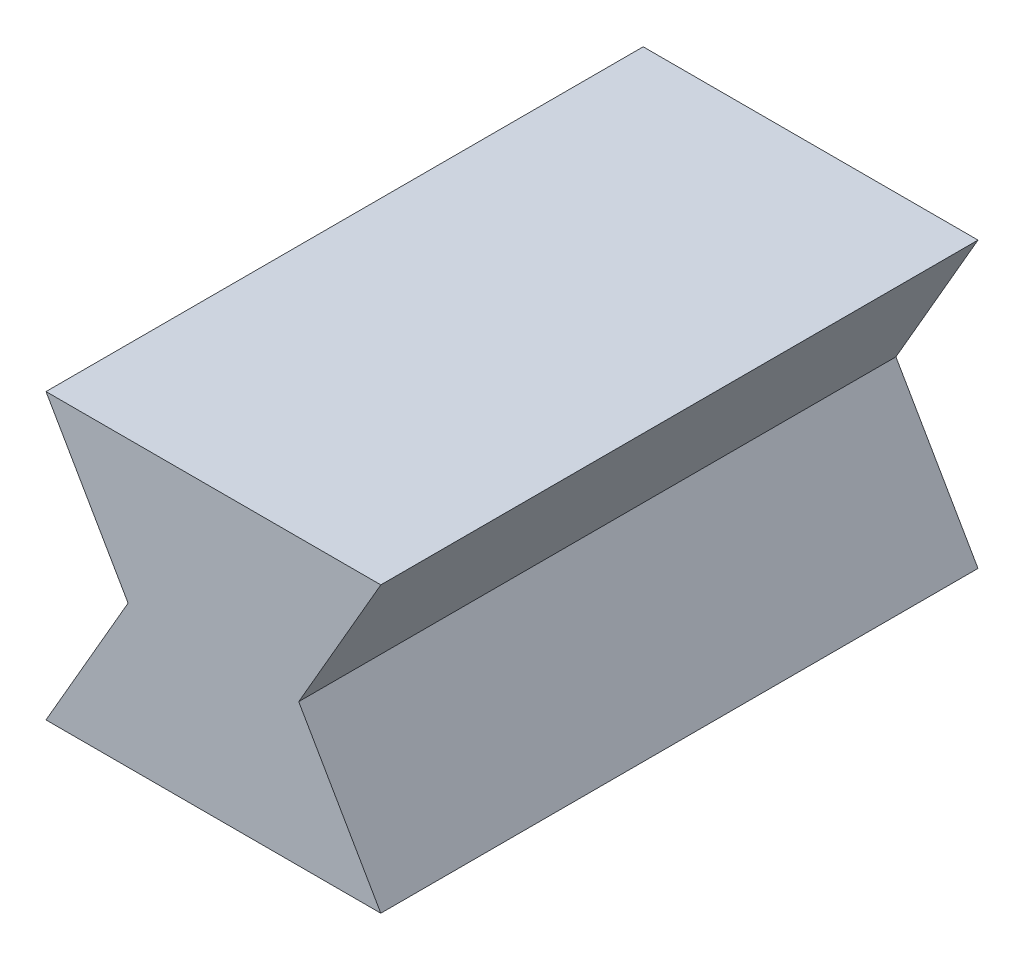
ISO-10303-21;
HEADER;
FILE_DESCRIPTION(('STEP AP214'),'2;1');
FILE_NAME('part.step','',(''),(''),'','','');
FILE_SCHEMA(('AUTOMOTIVE_DESIGN { 1 0 10303 214 1 1 1 1 }'));
ENDSEC;
DATA;
#1=APPLICATION_CONTEXT('core data for automotive mechanical design processes');
#2=APPLICATION_PROTOCOL_DEFINITION('international standard','automotive_design',2000,#1);
#3=PRODUCT_CONTEXT('',#1,'mechanical');
#4=PRODUCT('Part','Part','',(#3));
#5=PRODUCT_RELATED_PRODUCT_CATEGORY('part','',(#4));
#6=PRODUCT_DEFINITION_FORMATION('','',#4);
#7=PRODUCT_DEFINITION_CONTEXT('part definition',#1,'design');
#8=PRODUCT_DEFINITION('design','',#6,#7);
#9=PRODUCT_DEFINITION_SHAPE('','',#8);
#10=(LENGTH_UNIT() NAMED_UNIT(*) SI_UNIT(.MILLI.,.METRE.));
#11=(NAMED_UNIT(*) PLANE_ANGLE_UNIT() SI_UNIT($,.RADIAN.));
#12=(NAMED_UNIT(*) SI_UNIT($,.STERADIAN.) SOLID_ANGLE_UNIT());
#13=UNCERTAINTY_MEASURE_WITH_UNIT(LENGTH_MEASURE(1.E-05),#10,'distance_accuracy_value','');
#14=(GEOMETRIC_REPRESENTATION_CONTEXT(3) GLOBAL_UNCERTAINTY_ASSIGNED_CONTEXT((#13)) GLOBAL_UNIT_ASSIGNED_CONTEXT((#10,
#11,#12)) REPRESENTATION_CONTEXT('',''));
#15=CARTESIAN_POINT('',(0.,0.,0.));
#16=DIRECTION('',(0.,0.,1.));
#17=DIRECTION('',(1.,0.,0.));
#18=AXIS2_PLACEMENT_3D('',#15,#16,#17);
#19=CARTESIAN_POINT('',(-7.51392217919121,-7.81834255577111,10.5));
#20=DIRECTION('',(-0.866025403784436,0.500000000000004,0.));
#21=DIRECTION('',(-0.500000000000004,-0.866025403784436,0.));
#22=AXIS2_PLACEMENT_3D('',#19,#20,#21);
#23=PLANE('',#22);
#24=DIRECTION('',(0.500000000000005,0.866025403784436,0.));
#25=VECTOR('',#24,1.);
#26=CARTESIAN_POINT('',(-7.51392217919121,-7.81834255577111,-10.5));
#27=LINE('',#26,#25);
#28=CARTESIAN_POINT('',(-5.88675134594816,-5.,-10.5));
#29=VERTEX_POINT('',#28);
#30=CARTESIAN_POINT('',(-3.,0.,-10.5));
#31=VERTEX_POINT('',#30);
#32=EDGE_CURVE('E112',#29,#31,#27,.T.);
#33=ORIENTED_EDGE('',*,*,#32,.F.);
#34=DIRECTION('',(0.,0.,-1.));
#35=VECTOR('',#34,1.);
#36=CARTESIAN_POINT('',(-5.88675134594816,-5.,10.5));
#37=LINE('',#36,#35);
#38=CARTESIAN_POINT('',(-5.88675134594816,-5.,10.5));
#39=VERTEX_POINT('',#38);
#40=EDGE_CURVE('E11',#39,#29,#37,.T.);
#41=ORIENTED_EDGE('',*,*,#40,.F.);
#42=DIRECTION('',(0.500000000000005,0.866025403784436,0.));
#43=VECTOR('',#42,1.);
#44=CARTESIAN_POINT('',(-7.51392217919121,-7.81834255577111,10.5));
#45=LINE('',#44,#43);
#46=CARTESIAN_POINT('',(-3.,0.,10.5));
#47=VERTEX_POINT('',#46);
#48=EDGE_CURVE('E125',#39,#47,#45,.T.);
#49=ORIENTED_EDGE('',*,*,#48,.T.);
#50=DIRECTION('',(0.,0.,-1.));
#51=VECTOR('',#50,1.);
#52=CARTESIAN_POINT('',(-3.,0.,10.5));
#53=LINE('',#52,#51);
#54=EDGE_CURVE('E77',#47,#31,#53,.T.);
#55=ORIENTED_EDGE('',*,*,#54,.T.);
#56=EDGE_LOOP('',(#33,#41,#49,#55));
#57=FACE_BOUND('',#56,.T.);
#58=ADVANCED_FACE('F32',(#57),#23,.T.);
#59=CARTESIAN_POINT('',(0.,-5.,10.5));
#60=DIRECTION('',(0.,-1.,0.));
#61=DIRECTION('',(0.,0.,-1.));
#62=AXIS2_PLACEMENT_3D('',#59,#60,#61);
#63=PLANE('',#62);
#64=DIRECTION('',(-1.,0.,0.));
#65=VECTOR('',#64,1.);
#66=CARTESIAN_POINT('',(0.,-5.,-10.5));
#67=LINE('',#66,#65);
#68=CARTESIAN_POINT('',(5.88675134594816,-5.,-10.5));
#69=VERTEX_POINT('',#68);
#70=EDGE_CURVE('E115',#69,#29,#67,.T.);
#71=ORIENTED_EDGE('',*,*,#70,.F.);
#72=DIRECTION('',(0.,0.,-1.));
#73=VECTOR('',#72,1.);
#74=CARTESIAN_POINT('',(5.88675134594816,-5.,10.5));
#75=LINE('',#74,#73);
#76=CARTESIAN_POINT('',(5.88675134594816,-5.,10.5));
#77=VERTEX_POINT('',#76);
#78=EDGE_CURVE('E40',#77,#69,#75,.T.);
#79=ORIENTED_EDGE('',*,*,#78,.F.);
#80=DIRECTION('',(-1.,0.,0.));
#81=VECTOR('',#80,1.);
#82=CARTESIAN_POINT('',(0.,-5.,10.5));
#83=LINE('',#82,#81);
#84=EDGE_CURVE('E140',#77,#39,#83,.T.);
#85=ORIENTED_EDGE('',*,*,#84,.T.);
#86=ORIENTED_EDGE('',*,*,#40,.T.);
#87=EDGE_LOOP('',(#71,#79,#85,#86));
#88=FACE_BOUND('',#87,.T.);
#89=ADVANCED_FACE('F134',(#88),#63,.T.);
#90=CARTESIAN_POINT('',(7.51392217919124,-7.81834255577116,10.5));
#91=DIRECTION('',(0.866025403784436,0.500000000000004,0.));
#92=DIRECTION('',(-0.500000000000004,0.866025403784436,0.));
#93=AXIS2_PLACEMENT_3D('',#90,#91,#92);
#94=PLANE('',#93);
#95=DIRECTION('',(0.500000000000004,-0.866025403784436,0.));
#96=VECTOR('',#95,1.);
#97=CARTESIAN_POINT('',(7.51392217919124,-7.81834255577116,-10.5));
#98=LINE('',#97,#96);
#99=CARTESIAN_POINT('',(3.,0.,-10.5));
#100=VERTEX_POINT('',#99);
#101=EDGE_CURVE('E118',#100,#69,#98,.T.);
#102=ORIENTED_EDGE('',*,*,#101,.F.);
#103=DIRECTION('',(0.,0.,-1.));
#104=VECTOR('',#103,1.);
#105=CARTESIAN_POINT('',(3.,0.,10.5));
#106=LINE('',#105,#104);
#107=CARTESIAN_POINT('',(3.,0.,10.5));
#108=VERTEX_POINT('',#107);
#109=EDGE_CURVE('E104',#108,#100,#106,.T.);
#110=ORIENTED_EDGE('',*,*,#109,.F.);
#111=DIRECTION('',(0.500000000000004,-0.866025403784436,0.));
#112=VECTOR('',#111,1.);
#113=CARTESIAN_POINT('',(7.51392217919124,-7.81834255577116,10.5));
#114=LINE('',#113,#112);
#115=EDGE_CURVE('E97',#108,#77,#114,.T.);
#116=ORIENTED_EDGE('',*,*,#115,.T.);
#117=ORIENTED_EDGE('',*,*,#78,.T.);
#118=EDGE_LOOP('',(#102,#110,#116,#117));
#119=FACE_BOUND('',#118,.T.);
#120=ADVANCED_FACE('F131',(#119),#94,.T.);
#121=CARTESIAN_POINT('',(-3.01392217919111,-10.4164187671245,10.5));
#122=DIRECTION('',(-0.866025403784439,0.5,0.));
#123=DIRECTION('',(-0.5,-0.866025403784439,0.));
#124=AXIS2_PLACEMENT_3D('',#121,#122,#123);
#125=PLANE('',#124);
#126=DIRECTION('',(0.5,0.866025403784439,0.));
#127=VECTOR('',#126,1.);
#128=CARTESIAN_POINT('',(-3.01392217919111,-10.4164187671245,-10.5));
#129=LINE('',#128,#127);
#130=CARTESIAN_POINT('',(5.88675134594826,5.00000000000002,-10.5));
#131=VERTEX_POINT('',#130);
#132=EDGE_CURVE('E103',#100,#131,#129,.T.);
#133=ORIENTED_EDGE('',*,*,#132,.T.);
#134=DIRECTION('',(0.,0.,-1.));
#135=VECTOR('',#134,1.);
#136=CARTESIAN_POINT('',(5.88675134594826,5.00000000000002,10.5));
#137=LINE('',#136,#135);
#138=CARTESIAN_POINT('',(5.88675134594826,5.00000000000002,10.5));
#139=VERTEX_POINT('',#138);
#140=EDGE_CURVE('E100',#139,#131,#137,.T.);
#141=ORIENTED_EDGE('',*,*,#140,.F.);
#142=DIRECTION('',(0.5,0.866025403784439,0.));
#143=VECTOR('',#142,1.);
#144=CARTESIAN_POINT('',(-3.01392217919111,-10.4164187671245,10.5));
#145=LINE('',#144,#143);
#146=EDGE_CURVE('E90',#108,#139,#145,.T.);
#147=ORIENTED_EDGE('',*,*,#146,.F.);
#148=ORIENTED_EDGE('',*,*,#109,.T.);
#149=EDGE_LOOP('',(#133,#141,#147,#148));
#150=FACE_BOUND('',#149,.T.);
#151=ADVANCED_FACE('F101',(#150),#125,.F.);
#152=CARTESIAN_POINT('',(0.,5.00000000000002,10.5));
#153=DIRECTION('',(0.,-1.,0.));
#154=DIRECTION('',(0.,0.,-1.));
#155=AXIS2_PLACEMENT_3D('',#152,#153,#154);
#156=PLANE('',#155);
#157=DIRECTION('',(-1.,0.,0.));
#158=VECTOR('',#157,1.);
#159=CARTESIAN_POINT('',(0.,5.00000000000002,-10.5));
#160=LINE('',#159,#158);
#161=CARTESIAN_POINT('',(-5.88675134594814,5.00000000000002,-10.5));
#162=VERTEX_POINT('',#161);
#163=EDGE_CURVE('E70',#131,#162,#160,.T.);
#164=ORIENTED_EDGE('',*,*,#163,.T.);
#165=DIRECTION('',(0.,0.,-1.));
#166=VECTOR('',#165,1.);
#167=CARTESIAN_POINT('',(-5.88675134594814,5.00000000000002,10.5));
#168=LINE('',#167,#166);
#169=CARTESIAN_POINT('',(-5.88675134594814,5.00000000000002,10.5));
#170=VERTEX_POINT('',#169);
#171=EDGE_CURVE('E105',#170,#162,#168,.T.);
#172=ORIENTED_EDGE('',*,*,#171,.F.);
#173=DIRECTION('',(-1.,0.,0.));
#174=VECTOR('',#173,1.);
#175=CARTESIAN_POINT('',(0.,5.00000000000002,10.5));
#176=LINE('',#175,#174);
#177=EDGE_CURVE('E94',#139,#170,#176,.T.);
#178=ORIENTED_EDGE('',*,*,#177,.F.);
#179=ORIENTED_EDGE('',*,*,#140,.T.);
#180=EDGE_LOOP('',(#164,#172,#178,#179));
#181=FACE_BOUND('',#180,.T.);
#182=ADVANCED_FACE('F107',(#181),#156,.F.);
#183=CARTESIAN_POINT('',(3.01392217919122,-10.4164187671245,10.5));
#184=DIRECTION('',(0.866025403784439,0.5,0.));
#185=DIRECTION('',(-0.5,0.866025403784439,0.));
#186=AXIS2_PLACEMENT_3D('',#183,#184,#185);
#187=PLANE('',#186);
#188=DIRECTION('',(0.5,-0.866025403784439,0.));
#189=VECTOR('',#188,1.);
#190=CARTESIAN_POINT('',(3.01392217919122,-10.4164187671245,-10.5));
#191=LINE('',#190,#189);
#192=EDGE_CURVE('E123',#162,#31,#191,.T.);
#193=ORIENTED_EDGE('',*,*,#192,.T.);
#194=ORIENTED_EDGE('',*,*,#54,.F.);
#195=DIRECTION('',(0.5,-0.866025403784439,0.));
#196=VECTOR('',#195,1.);
#197=CARTESIAN_POINT('',(3.01392217919122,-10.4164187671245,10.5));
#198=LINE('',#197,#196);
#199=EDGE_CURVE('E48',#170,#47,#198,.T.);
#200=ORIENTED_EDGE('',*,*,#199,.F.);
#201=ORIENTED_EDGE('',*,*,#171,.T.);
#202=EDGE_LOOP('',(#193,#194,#200,#201));
#203=FACE_BOUND('',#202,.T.);
#204=ADVANCED_FACE('F139',(#203),#187,.F.);
#205=CARTESIAN_POINT('',(0.,-12.1565075485971,10.5));
#206=DIRECTION('',(0.,0.,1.));
#207=DIRECTION('',(1.,0.,0.));
#208=AXIS2_PLACEMENT_3D('',#205,#206,#207);
#209=PLANE('',#208);
#210=ORIENTED_EDGE('',*,*,#48,.F.);
#211=ORIENTED_EDGE('',*,*,#84,.F.);
#212=ORIENTED_EDGE('',*,*,#115,.F.);
#213=ORIENTED_EDGE('',*,*,#146,.T.);
#214=ORIENTED_EDGE('',*,*,#177,.T.);
#215=ORIENTED_EDGE('',*,*,#199,.T.);
#216=EDGE_LOOP('',(#210,#211,#212,#213,#214,#215));
#217=FACE_BOUND('',#216,.T.);
#218=ADVANCED_FACE('F92',(#217),#209,.T.);
#219=CARTESIAN_POINT('',(0.,-12.1565075485971,-10.5));
#220=DIRECTION('',(0.,0.,1.));
#221=DIRECTION('',(1.,0.,0.));
#222=AXIS2_PLACEMENT_3D('',#219,#220,#221);
#223=PLANE('',#222);
#224=ORIENTED_EDGE('',*,*,#32,.T.);
#225=ORIENTED_EDGE('',*,*,#192,.F.);
#226=ORIENTED_EDGE('',*,*,#163,.F.);
#227=ORIENTED_EDGE('',*,*,#132,.F.);
#228=ORIENTED_EDGE('',*,*,#101,.T.);
#229=ORIENTED_EDGE('',*,*,#70,.T.);
#230=EDGE_LOOP('',(#224,#225,#226,#227,#228,#229));
#231=FACE_BOUND('',#230,.T.);
#232=ADVANCED_FACE('F136',(#231),#223,.F.);
#233=CLOSED_SHELL('',(#58,#89,#120,#151,#182,#204,#218,#232));
#234=MANIFOLD_SOLID_BREP('B2',#233);
#235=ADVANCED_BREP_SHAPE_REPRESENTATION('',(#18,#234),#14);
#236=SHAPE_DEFINITION_REPRESENTATION(#9,#235);
ENDSEC;
END-ISO-10303-21;
